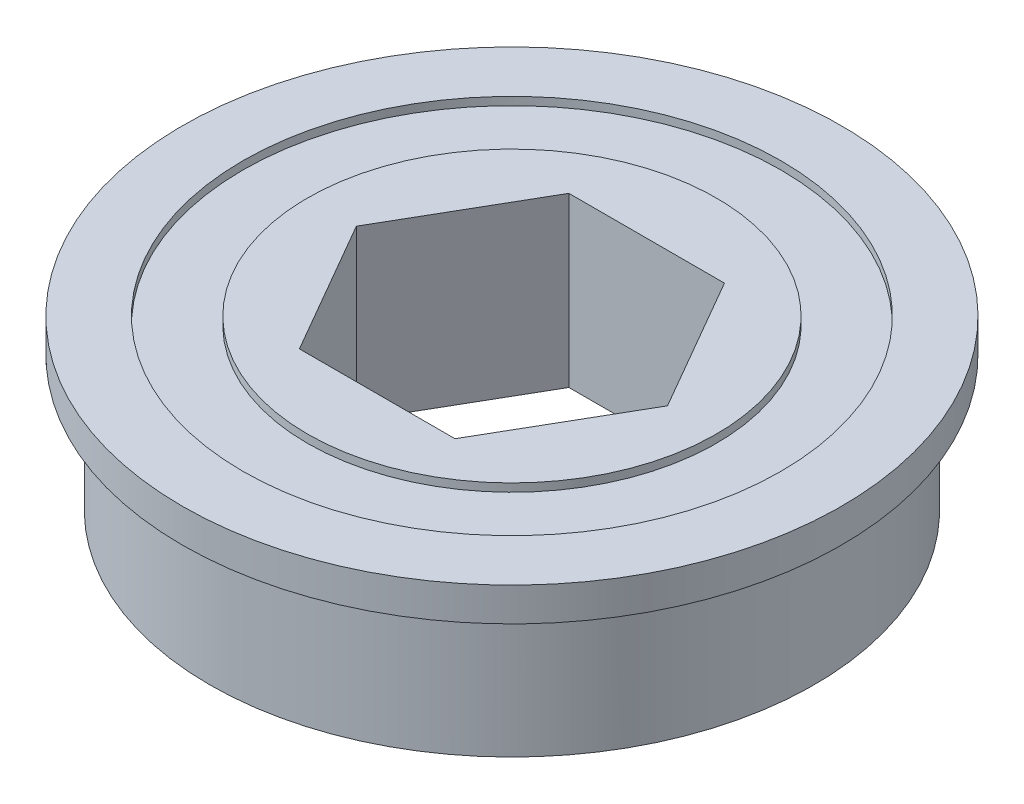
ISO-10303-21;
HEADER;
FILE_DESCRIPTION(('STEP AP214'),'2;1');
FILE_NAME('part.step','',(''),(''),'','','');
FILE_SCHEMA(('AUTOMOTIVE_DESIGN { 1 0 10303 214 1 1 1 1 }'));
ENDSEC;
DATA;
#1=APPLICATION_CONTEXT('core data for automotive mechanical design processes');
#2=APPLICATION_PROTOCOL_DEFINITION('international standard','automotive_design',2000,#1);
#3=PRODUCT_CONTEXT('',#1,'mechanical');
#4=PRODUCT('Part','Part','',(#3));
#5=PRODUCT_RELATED_PRODUCT_CATEGORY('part','',(#4));
#6=PRODUCT_DEFINITION_FORMATION('','',#4);
#7=PRODUCT_DEFINITION_CONTEXT('part definition',#1,'design');
#8=PRODUCT_DEFINITION('design','',#6,#7);
#9=PRODUCT_DEFINITION_SHAPE('','',#8);
#10=(LENGTH_UNIT() NAMED_UNIT(*) SI_UNIT(.MILLI.,.METRE.));
#11=(NAMED_UNIT(*) PLANE_ANGLE_UNIT() SI_UNIT($,.RADIAN.));
#12=(NAMED_UNIT(*) SI_UNIT($,.STERADIAN.) SOLID_ANGLE_UNIT());
#13=UNCERTAINTY_MEASURE_WITH_UNIT(LENGTH_MEASURE(1.E-05),#10,'distance_accuracy_value','');
#14=(GEOMETRIC_REPRESENTATION_CONTEXT(3) GLOBAL_UNCERTAINTY_ASSIGNED_CONTEXT((#13)) GLOBAL_UNIT_ASSIGNED_CONTEXT((#10,
#11,#12)) REPRESENTATION_CONTEXT('',''));
#15=CARTESIAN_POINT('',(0.,0.,0.));
#16=DIRECTION('',(0.,0.,1.));
#17=DIRECTION('',(1.,0.,0.));
#18=AXIS2_PLACEMENT_3D('',#15,#16,#17);
#19=CARTESIAN_POINT('',(0.,0.,0.));
#20=DIRECTION('',(0.,1.,0.));
#21=DIRECTION('',(0.,0.,1.));
#22=AXIS2_PLACEMENT_3D('',#19,#20,#21);
#23=CYLINDRICAL_SURFACE('',#22,12.7);
#24=CARTESIAN_POINT('',(0.,0.381,0.));
#25=DIRECTION('',(0.,1.,0.));
#26=DIRECTION('',(0.,0.,1.));
#27=AXIS2_PLACEMENT_3D('',#24,#25,#26);
#28=CIRCLE('',#27,12.7);
#29=CARTESIAN_POINT('',(0.,0.381,12.7));
#30=VERTEX_POINT('',#29);
#31=EDGE_CURVE('E127',#30,#30,#28,.F.);
#32=ORIENTED_EDGE('',*,*,#31,.F.);
#33=EDGE_LOOP('',(#32));
#34=FACE_BOUND('',#33,.T.);
#35=CARTESIAN_POINT('',(0.,0.,0.));
#36=DIRECTION('',(0.,1.,0.));
#37=DIRECTION('',(0.,0.,1.));
#38=AXIS2_PLACEMENT_3D('',#35,#36,#37);
#39=CIRCLE('',#38,12.7);
#40=CARTESIAN_POINT('',(0.,0.,12.7));
#41=VERTEX_POINT('',#40);
#42=EDGE_CURVE('E124',#41,#41,#39,.T.);
#43=ORIENTED_EDGE('',*,*,#42,.F.);
#44=EDGE_LOOP('',(#43));
#45=FACE_BOUND('',#44,.T.);
#46=ADVANCED_FACE('F15',(#34,#45),#23,.F.);
#47=CARTESIAN_POINT('',(9.652,0.381,0.));
#48=DIRECTION('',(0.,-1.,0.));
#49=DIRECTION('',(0.,0.,-1.));
#50=AXIS2_PLACEMENT_3D('',#47,#48,#49);
#51=PLANE('',#50);
#52=ORIENTED_EDGE('',*,*,#31,.T.);
#53=EDGE_LOOP('',(#52));
#54=FACE_BOUND('',#53,.T.);
#55=CARTESIAN_POINT('',(0.,0.381,0.));
#56=DIRECTION('',(0.,1.,0.));
#57=DIRECTION('',(0.,0.,1.));
#58=AXIS2_PLACEMENT_3D('',#55,#56,#57);
#59=CIRCLE('',#58,9.652);
#60=CARTESIAN_POINT('',(0.,0.381,9.652));
#61=VERTEX_POINT('',#60);
#62=EDGE_CURVE('E121',#61,#61,#59,.F.);
#63=ORIENTED_EDGE('',*,*,#62,.F.);
#64=EDGE_LOOP('',(#63));
#65=FACE_BOUND('',#64,.T.);
#66=ADVANCED_FACE('F356',(#54,#65),#51,.T.);
#67=CARTESIAN_POINT('',(14.2748,0.,0.));
#68=DIRECTION('',(0.,-1.,0.));
#69=DIRECTION('',(0.,0.,-1.));
#70=AXIS2_PLACEMENT_3D('',#67,#68,#69);
#71=PLANE('',#70);
#72=CARTESIAN_POINT('',(0.,0.,0.));
#73=DIRECTION('',(0.,1.,0.));
#74=DIRECTION('',(0.,0.,1.));
#75=AXIS2_PLACEMENT_3D('',#72,#73,#74);
#76=CIRCLE('',#75,14.2748);
#77=CARTESIAN_POINT('',(0.,0.,14.2748));
#78=VERTEX_POINT('',#77);
#79=EDGE_CURVE('E118',#78,#78,#76,.T.);
#80=ORIENTED_EDGE('',*,*,#79,.F.);
#81=EDGE_LOOP('',(#80));
#82=FACE_BOUND('',#81,.T.);
#83=ORIENTED_EDGE('',*,*,#42,.T.);
#84=EDGE_LOOP('',(#83));
#85=FACE_BOUND('',#84,.T.);
#86=ADVANCED_FACE('F346',(#82,#85),#71,.T.);
#87=CARTESIAN_POINT('',(0.,0.,0.));
#88=DIRECTION('',(0.,1.,0.));
#89=DIRECTION('',(0.,0.,1.));
#90=AXIS2_PLACEMENT_3D('',#87,#88,#89);
#91=CYLINDRICAL_SURFACE('',#90,9.652);
#92=CARTESIAN_POINT('',(0.,0.,0.));
#93=DIRECTION('',(0.,1.,0.));
#94=DIRECTION('',(0.,0.,1.));
#95=AXIS2_PLACEMENT_3D('',#92,#93,#94);
#96=CIRCLE('',#95,9.652);
#97=CARTESIAN_POINT('',(0.,0.,9.652));
#98=VERTEX_POINT('',#97);
#99=EDGE_CURVE('E98',#98,#98,#96,.F.);
#100=ORIENTED_EDGE('',*,*,#99,.F.);
#101=EDGE_LOOP('',(#100));
#102=FACE_BOUND('',#101,.T.);
#103=ORIENTED_EDGE('',*,*,#62,.T.);
#104=EDGE_LOOP('',(#103));
#105=FACE_BOUND('',#104,.T.);
#106=ADVANCED_FACE('F336',(#102,#105),#91,.T.);
#107=CARTESIAN_POINT('',(0.,0.,0.));
#108=DIRECTION('',(0.,1.,0.));
#109=DIRECTION('',(0.,0.,1.));
#110=AXIS2_PLACEMENT_3D('',#107,#108,#109);
#111=CYLINDRICAL_SURFACE('',#110,14.2748);
#112=ORIENTED_EDGE('',*,*,#79,.T.);
#113=EDGE_LOOP('',(#112));
#114=FACE_BOUND('',#113,.T.);
#115=CARTESIAN_POINT('',(0.,5.6,0.));
#116=DIRECTION('',(0.,-1.,0.));
#117=DIRECTION('',(0.,0.,-1.));
#118=AXIS2_PLACEMENT_3D('',#115,#116,#117);
#119=CIRCLE('',#118,14.2748);
#120=CARTESIAN_POINT('',(0.,5.6,-14.2748));
#121=VERTEX_POINT('',#120);
#122=EDGE_CURVE('E81',#121,#121,#119,.F.);
#123=ORIENTED_EDGE('',*,*,#122,.F.);
#124=EDGE_LOOP('',(#123));
#125=FACE_BOUND('',#124,.T.);
#126=ADVANCED_FACE('F326',(#114,#125),#111,.T.);
#127=CARTESIAN_POINT('',(9.652,0.,0.));
#128=DIRECTION('',(0.,-1.,0.));
#129=DIRECTION('',(0.,0.,-1.));
#130=AXIS2_PLACEMENT_3D('',#127,#128,#129);
#131=PLANE('',#130);
#132=ORIENTED_EDGE('',*,*,#99,.T.);
#133=EDGE_LOOP('',(#132));
#134=FACE_BOUND('',#133,.T.);
#135=DIRECTION('',(1.,0.,0.));
#136=VECTOR('',#135,1.);
#137=CARTESIAN_POINT('',(-3.67194771204601,0.,6.36));
#138=LINE('',#137,#136);
#139=CARTESIAN_POINT('',(-3.67194771204601,0.,6.36));
#140=VERTEX_POINT('',#139);
#141=CARTESIAN_POINT('',(3.67194771204602,0.,6.36));
#142=VERTEX_POINT('',#141);
#143=EDGE_CURVE('E60',#140,#142,#138,.T.);
#144=ORIENTED_EDGE('',*,*,#143,.T.);
#145=DIRECTION('',(0.5,0.,-0.866025403784439));
#146=VECTOR('',#145,1.);
#147=CARTESIAN_POINT('',(3.67194771204602,0.,6.36));
#148=LINE('',#147,#146);
#149=CARTESIAN_POINT('',(7.34389542409204,0.,0.));
#150=VERTEX_POINT('',#149);
#151=EDGE_CURVE('E62',#142,#150,#148,.T.);
#152=ORIENTED_EDGE('',*,*,#151,.T.);
#153=DIRECTION('',(-0.5,0.,-0.866025403784439));
#154=VECTOR('',#153,1.);
#155=CARTESIAN_POINT('',(7.34389542409204,0.,0.));
#156=LINE('',#155,#154);
#157=CARTESIAN_POINT('',(3.67194771204602,0.,-6.36));
#158=VERTEX_POINT('',#157);
#159=EDGE_CURVE('E65',#150,#158,#156,.T.);
#160=ORIENTED_EDGE('',*,*,#159,.T.);
#161=DIRECTION('',(-1.,0.,0.));
#162=VECTOR('',#161,1.);
#163=CARTESIAN_POINT('',(3.67194771204602,0.,-6.36));
#164=LINE('',#163,#162);
#165=CARTESIAN_POINT('',(-3.67194771204602,0.,-6.36));
#166=VERTEX_POINT('',#165);
#167=EDGE_CURVE('E190',#158,#166,#164,.T.);
#168=ORIENTED_EDGE('',*,*,#167,.T.);
#169=DIRECTION('',(-0.5,0.,0.866025403784439));
#170=VECTOR('',#169,1.);
#171=CARTESIAN_POINT('',(-3.67194771204602,0.,-6.36));
#172=LINE('',#171,#170);
#173=CARTESIAN_POINT('',(-7.34389542409204,0.,0.));
#174=VERTEX_POINT('',#173);
#175=EDGE_CURVE('E196',#166,#174,#172,.T.);
#176=ORIENTED_EDGE('',*,*,#175,.T.);
#177=DIRECTION('',(0.5,0.,0.866025403784439));
#178=VECTOR('',#177,1.);
#179=CARTESIAN_POINT('',(-7.34389542409204,0.,0.));
#180=LINE('',#179,#178);
#181=EDGE_CURVE('E201',#174,#140,#180,.T.);
#182=ORIENTED_EDGE('',*,*,#181,.T.);
#183=EDGE_LOOP('',(#144,#152,#160,#168,#176,#182));
#184=FACE_BOUND('',#183,.T.);
#185=ADVANCED_FACE('F64',(#134,#184),#131,.T.);
#186=CARTESIAN_POINT('',(0.,5.6,0.));
#187=DIRECTION('',(0.,-1.,0.));
#188=DIRECTION('',(0.,0.,-1.));
#189=AXIS2_PLACEMENT_3D('',#186,#187,#188);
#190=CONICAL_SURFACE('',#189,14.2748,0.523598775598298);
#191=CARTESIAN_POINT('',(0.,5.975,0.));
#192=DIRECTION('',(0.,1.,0.));
#193=DIRECTION('',(0.,0.,1.));
#194=AXIS2_PLACEMENT_3D('',#191,#192,#193);
#195=CIRCLE('',#194,14.0582936490539);
#196=CARTESIAN_POINT('',(0.,5.975,14.0582936490539));
#197=VERTEX_POINT('',#196);
#198=EDGE_CURVE('E92',#197,#197,#195,.F.);
#199=ORIENTED_EDGE('',*,*,#198,.T.);
#200=EDGE_LOOP('',(#199));
#201=FACE_BOUND('',#200,.T.);
#202=ORIENTED_EDGE('',*,*,#122,.T.);
#203=EDGE_LOOP('',(#202));
#204=FACE_BOUND('',#203,.T.);
#205=ADVANCED_FACE('F308',(#201,#204),#190,.T.);
#206=CARTESIAN_POINT('',(7.34389542409204,0.,0.));
#207=DIRECTION('',(0.866025403784439,0.,-0.5));
#208=DIRECTION('',(-0.5,0.,-0.866025403784439));
#209=AXIS2_PLACEMENT_3D('',#206,#207,#208);
#210=PLANE('',#209);
#211=DIRECTION('',(0.,1.,0.));
#212=VECTOR('',#211,1.);
#213=CARTESIAN_POINT('',(3.67194771204602,0.,-6.36));
#214=LINE('',#213,#212);
#215=CARTESIAN_POINT('',(3.67194771204602,7.9375,-6.36));
#216=VERTEX_POINT('',#215);
#217=EDGE_CURVE('E79',#216,#158,#214,.F.);
#218=ORIENTED_EDGE('',*,*,#217,.T.);
#219=ORIENTED_EDGE('',*,*,#159,.F.);
#220=DIRECTION('',(0.,1.,0.));
#221=VECTOR('',#220,1.);
#222=CARTESIAN_POINT('',(7.34389542409204,0.,0.));
#223=LINE('',#222,#221);
#224=CARTESIAN_POINT('',(7.34389542409204,7.9375,0.));
#225=VERTEX_POINT('',#224);
#226=EDGE_CURVE('E71',#150,#225,#223,.T.);
#227=ORIENTED_EDGE('',*,*,#226,.T.);
#228=DIRECTION('',(0.5,0.,0.866025403784438));
#229=VECTOR('',#228,1.);
#230=CARTESIAN_POINT('',(3.67194771204602,7.9375,-6.36));
#231=LINE('',#230,#229);
#232=EDGE_CURVE('E95',#216,#225,#231,.T.);
#233=ORIENTED_EDGE('',*,*,#232,.F.);
#234=EDGE_LOOP('',(#218,#219,#227,#233));
#235=FACE_BOUND('',#234,.T.);
#236=ADVANCED_FACE('F75',(#235),#210,.F.);
#237=CARTESIAN_POINT('',(3.67194771204602,0.,6.36));
#238=DIRECTION('',(0.866025403784439,0.,0.5));
#239=DIRECTION('',(0.5,0.,-0.866025403784439));
#240=AXIS2_PLACEMENT_3D('',#237,#238,#239);
#241=PLANE('',#240);
#242=ORIENTED_EDGE('',*,*,#226,.F.);
#243=ORIENTED_EDGE('',*,*,#151,.F.);
#244=DIRECTION('',(0.,1.,0.));
#245=VECTOR('',#244,1.);
#246=CARTESIAN_POINT('',(3.67194771204602,0.,6.36));
#247=LINE('',#246,#245);
#248=CARTESIAN_POINT('',(3.67194771204602,7.9375,6.36));
#249=VERTEX_POINT('',#248);
#250=EDGE_CURVE('E88',#142,#249,#247,.T.);
#251=ORIENTED_EDGE('',*,*,#250,.T.);
#252=DIRECTION('',(-0.5,0.,0.866025403784439));
#253=VECTOR('',#252,1.);
#254=CARTESIAN_POINT('',(7.34389542409204,7.9375,0.));
#255=LINE('',#254,#253);
#256=EDGE_CURVE('E85',#225,#249,#255,.T.);
#257=ORIENTED_EDGE('',*,*,#256,.F.);
#258=EDGE_LOOP('',(#242,#243,#251,#257));
#259=FACE_BOUND('',#258,.T.);
#260=ADVANCED_FACE('F83',(#259),#241,.F.);
#261=CARTESIAN_POINT('',(-3.67194771204601,0.,6.36));
#262=DIRECTION('',(0.,0.,1.));
#263=DIRECTION('',(1.,0.,0.));
#264=AXIS2_PLACEMENT_3D('',#261,#262,#263);
#265=PLANE('',#264);
#266=ORIENTED_EDGE('',*,*,#250,.F.);
#267=ORIENTED_EDGE('',*,*,#143,.F.);
#268=DIRECTION('',(0.,1.,0.));
#269=VECTOR('',#268,1.);
#270=CARTESIAN_POINT('',(-3.67194771204601,0.,6.36));
#271=LINE('',#270,#269);
#272=CARTESIAN_POINT('',(-3.67194771204601,7.9375,6.36));
#273=VERTEX_POINT('',#272);
#274=EDGE_CURVE('E198',#140,#273,#271,.T.);
#275=ORIENTED_EDGE('',*,*,#274,.T.);
#276=DIRECTION('',(1.,0.,0.));
#277=VECTOR('',#276,1.);
#278=CARTESIAN_POINT('',(6.35,7.9375,6.36));
#279=LINE('',#278,#277);
#280=EDGE_CURVE('E183',#249,#273,#279,.F.);
#281=ORIENTED_EDGE('',*,*,#280,.F.);
#282=EDGE_LOOP('',(#266,#267,#275,#281));
#283=FACE_BOUND('',#282,.T.);
#284=ADVANCED_FACE('F207',(#283),#265,.F.);
#285=CARTESIAN_POINT('',(-7.34389542409204,0.,0.));
#286=DIRECTION('',(-0.866025403784439,0.,0.5));
#287=DIRECTION('',(0.5,0.,0.866025403784439));
#288=AXIS2_PLACEMENT_3D('',#285,#286,#287);
#289=PLANE('',#288);
#290=ORIENTED_EDGE('',*,*,#274,.F.);
#291=ORIENTED_EDGE('',*,*,#181,.F.);
#292=DIRECTION('',(0.,1.,0.));
#293=VECTOR('',#292,1.);
#294=CARTESIAN_POINT('',(-7.34389542409204,0.,0.));
#295=LINE('',#294,#293);
#296=CARTESIAN_POINT('',(-7.34389542409204,7.9375,0.));
#297=VERTEX_POINT('',#296);
#298=EDGE_CURVE('E193',#174,#297,#295,.T.);
#299=ORIENTED_EDGE('',*,*,#298,.T.);
#300=DIRECTION('',(-0.5,0.,-0.866025403784439));
#301=VECTOR('',#300,1.);
#302=CARTESIAN_POINT('',(-3.67194771204601,7.9375,6.36));
#303=LINE('',#302,#301);
#304=EDGE_CURVE('E180',#273,#297,#303,.T.);
#305=ORIENTED_EDGE('',*,*,#304,.F.);
#306=EDGE_LOOP('',(#290,#291,#299,#305));
#307=FACE_BOUND('',#306,.T.);
#308=ADVANCED_FACE('F223',(#307),#289,.F.);
#309=CARTESIAN_POINT('',(-3.67194771204602,0.,-6.36));
#310=DIRECTION('',(-0.866025403784439,0.,-0.5));
#311=DIRECTION('',(-0.5,0.,0.866025403784439));
#312=AXIS2_PLACEMENT_3D('',#309,#310,#311);
#313=PLANE('',#312);
#314=ORIENTED_EDGE('',*,*,#298,.F.);
#315=ORIENTED_EDGE('',*,*,#175,.F.);
#316=DIRECTION('',(0.,1.,0.));
#317=VECTOR('',#316,1.);
#318=CARTESIAN_POINT('',(-3.67194771204602,0.,-6.36));
#319=LINE('',#318,#317);
#320=CARTESIAN_POINT('',(-3.67194771204602,7.9375,-6.36));
#321=VERTEX_POINT('',#320);
#322=EDGE_CURVE('E96',#166,#321,#319,.T.);
#323=ORIENTED_EDGE('',*,*,#322,.T.);
#324=DIRECTION('',(0.5,0.,-0.866025403784439));
#325=VECTOR('',#324,1.);
#326=CARTESIAN_POINT('',(-7.34389542409204,7.9375,0.));
#327=LINE('',#326,#325);
#328=EDGE_CURVE('E177',#297,#321,#327,.T.);
#329=ORIENTED_EDGE('',*,*,#328,.F.);
#330=EDGE_LOOP('',(#314,#315,#323,#329));
#331=FACE_BOUND('',#330,.T.);
#332=ADVANCED_FACE('F219',(#331),#313,.F.);
#333=CARTESIAN_POINT('',(3.67194771204602,0.,-6.36));
#334=DIRECTION('',(0.,0.,-1.));
#335=DIRECTION('',(-1.,0.,0.));
#336=AXIS2_PLACEMENT_3D('',#333,#334,#335);
#337=PLANE('',#336);
#338=ORIENTED_EDGE('',*,*,#322,.F.);
#339=ORIENTED_EDGE('',*,*,#167,.F.);
#340=ORIENTED_EDGE('',*,*,#217,.F.);
#341=DIRECTION('',(1.,0.,0.));
#342=VECTOR('',#341,1.);
#343=CARTESIAN_POINT('',(6.35,7.9375,-6.36));
#344=LINE('',#343,#342);
#345=EDGE_CURVE('E115',#321,#216,#344,.T.);
#346=ORIENTED_EDGE('',*,*,#345,.F.);
#347=EDGE_LOOP('',(#338,#339,#340,#346));
#348=FACE_BOUND('',#347,.T.);
#349=ADVANCED_FACE('F214',(#348),#337,.F.);
#350=CARTESIAN_POINT('',(6.35,7.9375,0.));
#351=DIRECTION('',(0.,1.,0.));
#352=DIRECTION('',(0.,0.,1.));
#353=AXIS2_PLACEMENT_3D('',#350,#351,#352);
#354=PLANE('',#353);
#355=CARTESIAN_POINT('',(0.,7.9375,0.));
#356=DIRECTION('',(0.,1.,0.));
#357=DIRECTION('',(0.,0.,1.));
#358=AXIS2_PLACEMENT_3D('',#355,#356,#357);
#359=CIRCLE('',#358,9.652);
#360=CARTESIAN_POINT('',(0.,7.9375,9.652));
#361=VERTEX_POINT('',#360);
#362=EDGE_CURVE('E111',#361,#361,#359,.F.);
#363=ORIENTED_EDGE('',*,*,#362,.F.);
#364=EDGE_LOOP('',(#363));
#365=FACE_BOUND('',#364,.T.);
#366=ORIENTED_EDGE('',*,*,#328,.T.);
#367=ORIENTED_EDGE('',*,*,#345,.T.);
#368=ORIENTED_EDGE('',*,*,#232,.T.);
#369=ORIENTED_EDGE('',*,*,#256,.T.);
#370=ORIENTED_EDGE('',*,*,#280,.T.);
#371=ORIENTED_EDGE('',*,*,#304,.T.);
#372=EDGE_LOOP('',(#366,#367,#368,#369,#370,#371));
#373=FACE_BOUND('',#372,.T.);
#374=ADVANCED_FACE('F162',(#365,#373),#354,.T.);
#375=CARTESIAN_POINT('',(0.,6.1,0.));
#376=DIRECTION('',(0.,1.,0.));
#377=DIRECTION('',(0.,0.,1.));
#378=AXIS2_PLACEMENT_3D('',#375,#376,#377);
#379=TOROIDAL_SURFACE('',#378,14.2748,0.25);
#380=ORIENTED_EDGE('',*,*,#198,.F.);
#381=EDGE_LOOP('',(#380));
#382=FACE_BOUND('',#381,.T.);
#383=CARTESIAN_POINT('',(0.,6.35,0.));
#384=DIRECTION('',(0.,-1.,0.));
#385=DIRECTION('',(0.,0.,-1.));
#386=AXIS2_PLACEMENT_3D('',#383,#384,#385);
#387=CIRCLE('',#386,14.2748);
#388=CARTESIAN_POINT('',(0.,6.35,14.2748));
#389=VERTEX_POINT('',#388);
#390=CARTESIAN_POINT('',(0.,6.35,-14.2748));
#391=VERTEX_POINT('',#390);
#392=EDGE_CURVE('E114',#389,#391,#387,.F.);
#393=ORIENTED_EDGE('',*,*,#392,.F.);
#394=CARTESIAN_POINT('',(0.,6.35,0.));
#395=DIRECTION('',(0.,-1.,0.));
#396=DIRECTION('',(0.,0.,1.));
#397=AXIS2_PLACEMENT_3D('',#394,#395,#396);
#398=CIRCLE('',#397,14.2748);
#399=EDGE_CURVE('E34',#391,#389,#398,.F.);
#400=ORIENTED_EDGE('',*,*,#399,.F.);
#401=EDGE_LOOP('',(#393,#400));
#402=FACE_BOUND('',#401,.T.);
#403=ADVANCED_FACE('F129',(#382,#402),#379,.F.);
#404=CARTESIAN_POINT('',(0.,0.,0.));
#405=DIRECTION('',(0.,1.,0.));
#406=DIRECTION('',(0.,0.,1.));
#407=AXIS2_PLACEMENT_3D('',#404,#405,#406);
#408=CYLINDRICAL_SURFACE('',#407,9.652);
#409=CARTESIAN_POINT('',(0.,7.5565,0.));
#410=DIRECTION('',(0.,1.,0.));
#411=DIRECTION('',(0.,0.,1.));
#412=AXIS2_PLACEMENT_3D('',#409,#410,#411);
#413=CIRCLE('',#412,9.652);
#414=CARTESIAN_POINT('',(0.,7.5565,9.652));
#415=VERTEX_POINT('',#414);
#416=EDGE_CURVE('E108',#415,#415,#413,.F.);
#417=ORIENTED_EDGE('',*,*,#416,.F.);
#418=EDGE_LOOP('',(#417));
#419=FACE_BOUND('',#418,.T.);
#420=ORIENTED_EDGE('',*,*,#362,.T.);
#421=EDGE_LOOP('',(#420));
#422=FACE_BOUND('',#421,.T.);
#423=ADVANCED_FACE('F153',(#419,#422),#408,.T.);
#424=CARTESIAN_POINT('',(15.5575,6.35,0.));
#425=DIRECTION('',(0.,-1.,0.));
#426=DIRECTION('',(0.,0.,-1.));
#427=AXIS2_PLACEMENT_3D('',#424,#425,#426);
#428=PLANE('',#427);
#429=CARTESIAN_POINT('',(0.,6.35,0.));
#430=DIRECTION('',(0.,1.,0.));
#431=DIRECTION('',(0.,0.,1.));
#432=AXIS2_PLACEMENT_3D('',#429,#430,#431);
#433=CIRCLE('',#432,15.5575);
#434=CARTESIAN_POINT('',(0.,6.35,15.5575));
#435=VERTEX_POINT('',#434);
#436=EDGE_CURVE('E105',#435,#435,#433,.T.);
#437=ORIENTED_EDGE('',*,*,#436,.F.);
#438=EDGE_LOOP('',(#437));
#439=FACE_BOUND('',#438,.T.);
#440=ORIENTED_EDGE('',*,*,#392,.T.);
#441=ORIENTED_EDGE('',*,*,#399,.T.);
#442=EDGE_LOOP('',(#440,#441));
#443=FACE_BOUND('',#442,.T.);
#444=ADVANCED_FACE('F133',(#439,#443),#428,.T.);
#445=CARTESIAN_POINT('',(9.652,7.5565,0.));
#446=DIRECTION('',(0.,1.,0.));
#447=DIRECTION('',(0.,0.,1.));
#448=AXIS2_PLACEMENT_3D('',#445,#446,#447);
#449=PLANE('',#448);
#450=ORIENTED_EDGE('',*,*,#416,.T.);
#451=EDGE_LOOP('',(#450));
#452=FACE_BOUND('',#451,.T.);
#453=CARTESIAN_POINT('',(0.,7.5565,0.));
#454=DIRECTION('',(0.,1.,0.));
#455=DIRECTION('',(0.,0.,1.));
#456=AXIS2_PLACEMENT_3D('',#453,#454,#455);
#457=CIRCLE('',#456,12.7);
#458=CARTESIAN_POINT('',(0.,7.5565,12.7));
#459=VERTEX_POINT('',#458);
#460=EDGE_CURVE('E102',#459,#459,#457,.T.);
#461=ORIENTED_EDGE('',*,*,#460,.T.);
#462=EDGE_LOOP('',(#461));
#463=FACE_BOUND('',#462,.T.);
#464=ADVANCED_FACE('F152',(#452,#463),#449,.T.);
#465=CARTESIAN_POINT('',(0.,0.,0.));
#466=DIRECTION('',(0.,1.,0.));
#467=DIRECTION('',(0.,0.,1.));
#468=AXIS2_PLACEMENT_3D('',#465,#466,#467);
#469=CYLINDRICAL_SURFACE('',#468,15.5575);
#470=ORIENTED_EDGE('',*,*,#436,.T.);
#471=EDGE_LOOP('',(#470));
#472=FACE_BOUND('',#471,.T.);
#473=CARTESIAN_POINT('',(0.,7.9375,0.));
#474=DIRECTION('',(0.,1.,0.));
#475=DIRECTION('',(0.,0.,1.));
#476=AXIS2_PLACEMENT_3D('',#473,#474,#475);
#477=CIRCLE('',#476,15.5575);
#478=CARTESIAN_POINT('',(0.,7.9375,15.5575));
#479=VERTEX_POINT('',#478);
#480=EDGE_CURVE('E26',#479,#479,#477,.T.);
#481=ORIENTED_EDGE('',*,*,#480,.F.);
#482=EDGE_LOOP('',(#481));
#483=FACE_BOUND('',#482,.T.);
#484=ADVANCED_FACE('F244',(#472,#483),#469,.T.);
#485=CARTESIAN_POINT('',(0.,0.,0.));
#486=DIRECTION('',(0.,1.,0.));
#487=DIRECTION('',(0.,0.,1.));
#488=AXIS2_PLACEMENT_3D('',#485,#486,#487);
#489=CYLINDRICAL_SURFACE('',#488,12.7);
#490=CARTESIAN_POINT('',(0.,7.9375,0.));
#491=DIRECTION('',(0.,1.,0.));
#492=DIRECTION('',(0.,0.,1.));
#493=AXIS2_PLACEMENT_3D('',#490,#491,#492);
#494=CIRCLE('',#493,12.7);
#495=CARTESIAN_POINT('',(0.,7.9375,12.7));
#496=VERTEX_POINT('',#495);
#497=EDGE_CURVE('E10',#496,#496,#494,.F.);
#498=ORIENTED_EDGE('',*,*,#497,.F.);
#499=EDGE_LOOP('',(#498));
#500=FACE_BOUND('',#499,.T.);
#501=ORIENTED_EDGE('',*,*,#460,.F.);
#502=EDGE_LOOP('',(#501));
#503=FACE_BOUND('',#502,.T.);
#504=ADVANCED_FACE('F238',(#500,#503),#489,.F.);
#505=CARTESIAN_POINT('',(12.7,7.9375,0.));
#506=DIRECTION('',(0.,1.,0.));
#507=DIRECTION('',(0.,0.,1.));
#508=AXIS2_PLACEMENT_3D('',#505,#506,#507);
#509=PLANE('',#508);
#510=ORIENTED_EDGE('',*,*,#497,.T.);
#511=EDGE_LOOP('',(#510));
#512=FACE_BOUND('',#511,.T.);
#513=ORIENTED_EDGE('',*,*,#480,.T.);
#514=EDGE_LOOP('',(#513));
#515=FACE_BOUND('',#514,.T.);
#516=ADVANCED_FACE('F236',(#512,#515),#509,.T.);
#517=CLOSED_SHELL('',(#46,#66,#86,#106,#126,#185,#205,#236,#260,#284,#308,#332,#349,#374,#403,
#423,#444,#464,#484,#504,#516));
#518=MANIFOLD_SOLID_BREP('B1',#517);
#519=ADVANCED_BREP_SHAPE_REPRESENTATION('',(#18,#518),#14);
#520=SHAPE_DEFINITION_REPRESENTATION(#9,#519);
ENDSEC;
END-ISO-10303-21;
